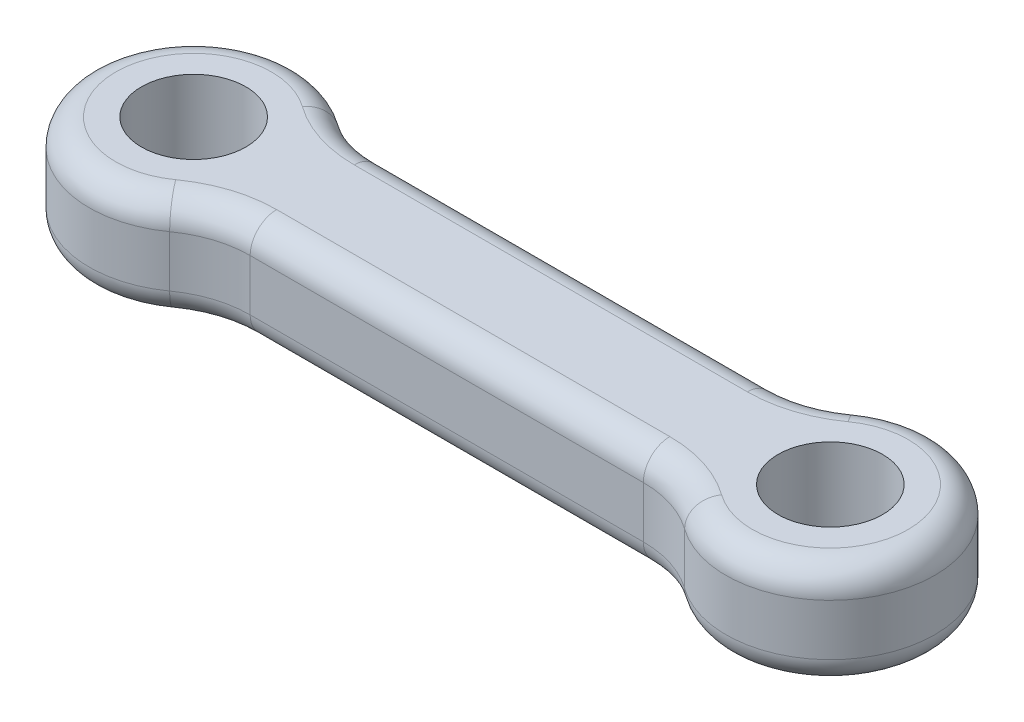
ISO-10303-21;
HEADER;
FILE_DESCRIPTION(('STEP AP214'),'2;1');
FILE_NAME('part.step','',(''),(''),'','','');
FILE_SCHEMA(('AUTOMOTIVE_DESIGN { 1 0 10303 214 1 1 1 1 }'));
ENDSEC;
DATA;
#1=APPLICATION_CONTEXT('core data for automotive mechanical design processes');
#2=APPLICATION_PROTOCOL_DEFINITION('international standard','automotive_design',2000,#1);
#3=PRODUCT_CONTEXT('',#1,'mechanical');
#4=PRODUCT('Part','Part','',(#3));
#5=PRODUCT_RELATED_PRODUCT_CATEGORY('part','',(#4));
#6=PRODUCT_DEFINITION_FORMATION('','',#4);
#7=PRODUCT_DEFINITION_CONTEXT('part definition',#1,'design');
#8=PRODUCT_DEFINITION('design','',#6,#7);
#9=PRODUCT_DEFINITION_SHAPE('','',#8);
#10=(LENGTH_UNIT() NAMED_UNIT(*) SI_UNIT(.MILLI.,.METRE.));
#11=(NAMED_UNIT(*) PLANE_ANGLE_UNIT() SI_UNIT($,.RADIAN.));
#12=(NAMED_UNIT(*) SI_UNIT($,.STERADIAN.) SOLID_ANGLE_UNIT());
#13=UNCERTAINTY_MEASURE_WITH_UNIT(LENGTH_MEASURE(1.E-05),#10,'distance_accuracy_value','');
#14=(GEOMETRIC_REPRESENTATION_CONTEXT(3) GLOBAL_UNCERTAINTY_ASSIGNED_CONTEXT((#13)) GLOBAL_UNIT_ASSIGNED_CONTEXT((#10,
#11,#12)) REPRESENTATION_CONTEXT('',''));
#15=CARTESIAN_POINT('',(0.,0.,0.));
#16=DIRECTION('',(0.,0.,1.));
#17=DIRECTION('',(1.,0.,0.));
#18=AXIS2_PLACEMENT_3D('',#15,#16,#17);
#19=CARTESIAN_POINT('',(2.81828771879828,8.3,-10.725));
#20=DIRECTION('',(0.,1.,0.));
#21=DIRECTION('',(0.,0.,1.));
#22=AXIS2_PLACEMENT_3D('',#19,#20,#21);
#23=PLANE('',#22);
#24=CARTESIAN_POINT('',(27.6617122812017,8.3,10.725));
#25=DIRECTION('',(0.,1.,0.));
#26=DIRECTION('',(0.,0.,1.));
#27=AXIS2_PLACEMENT_3D('',#24,#25,#26);
#28=CIRCLE('',#27,8.2764);
#29=CARTESIAN_POINT('',(27.6617122812017,8.3,2.4486));
#30=VERTEX_POINT('',#29);
#31=CARTESIAN_POINT('',(32.4865322808882,8.3,4.000425));
#32=VERTEX_POINT('',#31);
#33=EDGE_CURVE('E269',#30,#32,#28,.F.);
#34=ORIENTED_EDGE('',*,*,#33,.T.);
#35=CARTESIAN_POINT('',(35.3568,8.3,0.));
#36=DIRECTION('',(0.,1.,0.));
#37=DIRECTION('',(0.,0.,1.));
#38=AXIS2_PLACEMENT_3D('',#35,#36,#37);
#39=CIRCLE('',#38,4.9236);
#40=CARTESIAN_POINT('',(32.4865322808882,8.3,-4.000425));
#41=VERTEX_POINT('',#40);
#42=EDGE_CURVE('E156',#32,#41,#39,.T.);
#43=ORIENTED_EDGE('',*,*,#42,.T.);
#44=CARTESIAN_POINT('',(27.6617122812017,8.3,-10.725));
#45=DIRECTION('',(0.,1.,0.));
#46=DIRECTION('',(0.,0.,1.));
#47=AXIS2_PLACEMENT_3D('',#44,#45,#46);
#48=CIRCLE('',#47,8.2764);
#49=CARTESIAN_POINT('',(27.6617122812017,8.3,-2.4486));
#50=VERTEX_POINT('',#49);
#51=EDGE_CURVE('E150',#41,#50,#48,.F.);
#52=ORIENTED_EDGE('',*,*,#51,.T.);
#53=DIRECTION('',(-1.,0.,0.));
#54=VECTOR('',#53,1.);
#55=CARTESIAN_POINT('',(2.81828771879828,8.3,-2.4486));
#56=LINE('',#55,#54);
#57=CARTESIAN_POINT('',(2.81828771879828,8.3,-2.4486));
#58=VERTEX_POINT('',#57);
#59=EDGE_CURVE('E153',#50,#58,#56,.T.);
#60=ORIENTED_EDGE('',*,*,#59,.T.);
#61=CARTESIAN_POINT('',(2.81828771879828,8.3,-10.725));
#62=DIRECTION('',(0.,1.,0.));
#63=DIRECTION('',(0.,0.,1.));
#64=AXIS2_PLACEMENT_3D('',#61,#62,#63);
#65=CIRCLE('',#64,8.2764);
#66=CARTESIAN_POINT('',(-2.00653228088824,8.3,-4.000425));
#67=VERTEX_POINT('',#66);
#68=EDGE_CURVE('E160',#58,#67,#65,.F.);
#69=ORIENTED_EDGE('',*,*,#68,.T.);
#70=CARTESIAN_POINT('',(-4.8768,8.3,0.));
#71=DIRECTION('',(0.,1.,0.));
#72=DIRECTION('',(0.,0.,1.));
#73=AXIS2_PLACEMENT_3D('',#70,#71,#72);
#74=CIRCLE('',#73,4.9236);
#75=CARTESIAN_POINT('',(-2.00653228088825,8.3,4.000425));
#76=VERTEX_POINT('',#75);
#77=EDGE_CURVE('E275',#67,#76,#74,.T.);
#78=ORIENTED_EDGE('',*,*,#77,.T.);
#79=CARTESIAN_POINT('',(2.81828771879828,8.3,10.725));
#80=DIRECTION('',(0.,1.,0.));
#81=DIRECTION('',(0.,0.,1.));
#82=AXIS2_PLACEMENT_3D('',#79,#80,#81);
#83=CIRCLE('',#82,8.2764);
#84=CARTESIAN_POINT('',(2.81828771879828,8.3,2.4486));
#85=VERTEX_POINT('',#84);
#86=EDGE_CURVE('E273',#76,#85,#83,.F.);
#87=ORIENTED_EDGE('',*,*,#86,.T.);
#88=DIRECTION('',(1.,0.,0.));
#89=VECTOR('',#88,1.);
#90=CARTESIAN_POINT('',(27.6617122812017,8.3,2.4486));
#91=LINE('',#90,#89);
#92=EDGE_CURVE('E271',#85,#30,#91,.T.);
#93=ORIENTED_EDGE('',*,*,#92,.T.);
#94=EDGE_LOOP('',(#34,#43,#52,#60,#69,#78,#87,#93));
#95=FACE_BOUND('',#94,.T.);
#96=CARTESIAN_POINT('',(-4.8768,8.3,0.));
#97=DIRECTION('',(0.,1.,0.));
#98=DIRECTION('',(0.,0.,1.));
#99=AXIS2_PLACEMENT_3D('',#96,#97,#98);
#100=CIRCLE('',#99,3.3);
#101=CARTESIAN_POINT('',(-4.8768,8.3,3.3));
#102=VERTEX_POINT('',#101);
#103=EDGE_CURVE('E299',#102,#102,#100,.T.);
#104=ORIENTED_EDGE('',*,*,#103,.F.);
#105=EDGE_LOOP('',(#104));
#106=FACE_BOUND('',#105,.T.);
#107=CARTESIAN_POINT('',(35.3568,8.3,0.));
#108=DIRECTION('',(0.,1.,0.));
#109=DIRECTION('',(0.,0.,-1.));
#110=AXIS2_PLACEMENT_3D('',#107,#108,#109);
#111=CIRCLE('',#110,3.3);
#112=CARTESIAN_POINT('',(35.3568,8.3,-3.3));
#113=VERTEX_POINT('',#112);
#114=EDGE_CURVE('E303',#113,#113,#111,.T.);
#115=ORIENTED_EDGE('',*,*,#114,.F.);
#116=EDGE_LOOP('',(#115));
#117=FACE_BOUND('',#116,.T.);
#118=ADVANCED_FACE('F35',(#95,#106,#117),#23,.T.);
#119=CARTESIAN_POINT('',(2.81828771879828,1.7,-10.725));
#120=DIRECTION('',(0.,1.,0.));
#121=DIRECTION('',(0.,0.,1.));
#122=AXIS2_PLACEMENT_3D('',#119,#120,#121);
#123=PLANE('',#122);
#124=CARTESIAN_POINT('',(2.81828771879828,1.7,10.725));
#125=DIRECTION('',(0.,1.,0.));
#126=DIRECTION('',(0.,0.,1.));
#127=AXIS2_PLACEMENT_3D('',#124,#125,#126);
#128=CIRCLE('',#127,8.2764);
#129=CARTESIAN_POINT('',(2.81828771879828,1.7,2.4486));
#130=VERTEX_POINT('',#129);
#131=CARTESIAN_POINT('',(-2.00653228088824,1.7,4.000425));
#132=VERTEX_POINT('',#131);
#133=EDGE_CURVE('E228',#130,#132,#128,.T.);
#134=ORIENTED_EDGE('',*,*,#133,.T.);
#135=CARTESIAN_POINT('',(-4.8768,1.7,0.));
#136=DIRECTION('',(0.,1.,0.));
#137=DIRECTION('',(0.,0.,1.));
#138=AXIS2_PLACEMENT_3D('',#135,#136,#137);
#139=CIRCLE('',#138,4.9236);
#140=CARTESIAN_POINT('',(-2.00653228088824,1.7,-4.000425));
#141=VERTEX_POINT('',#140);
#142=EDGE_CURVE('E225',#132,#141,#139,.F.);
#143=ORIENTED_EDGE('',*,*,#142,.T.);
#144=CARTESIAN_POINT('',(2.81828771879828,1.7,-10.725));
#145=DIRECTION('',(0.,1.,0.));
#146=DIRECTION('',(0.,0.,1.));
#147=AXIS2_PLACEMENT_3D('',#144,#145,#146);
#148=CIRCLE('',#147,8.2764);
#149=CARTESIAN_POINT('',(2.81828771879828,1.7,-2.4486));
#150=VERTEX_POINT('',#149);
#151=EDGE_CURVE('E240',#141,#150,#148,.T.);
#152=ORIENTED_EDGE('',*,*,#151,.T.);
#153=DIRECTION('',(-1.,0.,0.));
#154=VECTOR('',#153,1.);
#155=CARTESIAN_POINT('',(2.81828771879828,1.7,-2.4486));
#156=LINE('',#155,#154);
#157=CARTESIAN_POINT('',(27.6617122812017,1.7,-2.4486));
#158=VERTEX_POINT('',#157);
#159=EDGE_CURVE('E238',#150,#158,#156,.F.);
#160=ORIENTED_EDGE('',*,*,#159,.T.);
#161=CARTESIAN_POINT('',(27.6617122812017,1.7,-10.725));
#162=DIRECTION('',(0.,1.,0.));
#163=DIRECTION('',(0.,0.,1.));
#164=AXIS2_PLACEMENT_3D('',#161,#162,#163);
#165=CIRCLE('',#164,8.2764);
#166=CARTESIAN_POINT('',(32.4865322808882,1.7,-4.000425));
#167=VERTEX_POINT('',#166);
#168=EDGE_CURVE('E236',#158,#167,#165,.T.);
#169=ORIENTED_EDGE('',*,*,#168,.T.);
#170=CARTESIAN_POINT('',(35.3568,1.7,0.));
#171=DIRECTION('',(0.,1.,0.));
#172=DIRECTION('',(0.,0.,1.));
#173=AXIS2_PLACEMENT_3D('',#170,#171,#172);
#174=CIRCLE('',#173,4.9236);
#175=CARTESIAN_POINT('',(32.4865322808882,1.7,4.000425));
#176=VERTEX_POINT('',#175);
#177=EDGE_CURVE('E234',#167,#176,#174,.F.);
#178=ORIENTED_EDGE('',*,*,#177,.T.);
#179=CARTESIAN_POINT('',(27.6617122812017,1.7,10.725));
#180=DIRECTION('',(0.,1.,0.));
#181=DIRECTION('',(0.,0.,1.));
#182=AXIS2_PLACEMENT_3D('',#179,#180,#181);
#183=CIRCLE('',#182,8.2764);
#184=CARTESIAN_POINT('',(27.6617122812017,1.7,2.4486));
#185=VERTEX_POINT('',#184);
#186=EDGE_CURVE('E232',#176,#185,#183,.T.);
#187=ORIENTED_EDGE('',*,*,#186,.T.);
#188=DIRECTION('',(1.,0.,0.));
#189=VECTOR('',#188,1.);
#190=CARTESIAN_POINT('',(2.81828771879828,1.7,2.4486));
#191=LINE('',#190,#189);
#192=EDGE_CURVE('E230',#185,#130,#191,.F.);
#193=ORIENTED_EDGE('',*,*,#192,.T.);
#194=EDGE_LOOP('',(#134,#143,#152,#160,#169,#178,#187,#193));
#195=FACE_BOUND('',#194,.T.);
#196=CARTESIAN_POINT('',(-4.8768,1.7,0.));
#197=DIRECTION('',(0.,1.,0.));
#198=DIRECTION('',(0.,0.,1.));
#199=AXIS2_PLACEMENT_3D('',#196,#197,#198);
#200=CIRCLE('',#199,3.3);
#201=CARTESIAN_POINT('',(-4.8768,1.7,3.3));
#202=VERTEX_POINT('',#201);
#203=EDGE_CURVE('E300',#202,#202,#200,.T.);
#204=ORIENTED_EDGE('',*,*,#203,.T.);
#205=EDGE_LOOP('',(#204));
#206=FACE_BOUND('',#205,.T.);
#207=CARTESIAN_POINT('',(35.3568,1.7,0.));
#208=DIRECTION('',(0.,1.,0.));
#209=DIRECTION('',(0.,0.,-1.));
#210=AXIS2_PLACEMENT_3D('',#207,#208,#209);
#211=CIRCLE('',#210,3.3);
#212=CARTESIAN_POINT('',(35.3568,1.7,-3.3));
#213=VERTEX_POINT('',#212);
#214=EDGE_CURVE('E193',#213,#213,#211,.T.);
#215=ORIENTED_EDGE('',*,*,#214,.T.);
#216=EDGE_LOOP('',(#215));
#217=FACE_BOUND('',#216,.T.);
#218=ADVANCED_FACE('F315',(#195,#206,#217),#123,.F.);
#219=CARTESIAN_POINT('',(2.81828771879828,8.3,-10.725));
#220=DIRECTION('',(0.,-1.,0.));
#221=DIRECTION('',(0.,0.,-1.));
#222=AXIS2_PLACEMENT_3D('',#219,#220,#221);
#223=CYLINDRICAL_SURFACE('',#222,6.6);
#224=DIRECTION('',(0.,-1.,0.));
#225=VECTOR('',#224,1.);
#226=CARTESIAN_POINT('',(-1.02925614060086,8.3,-5.3625));
#227=LINE('',#226,#225);
#228=CARTESIAN_POINT('',(-1.02925614060086,6.6236,-5.3625));
#229=VERTEX_POINT('',#228);
#230=CARTESIAN_POINT('',(-1.02925614060086,3.3764,-5.3625));
#231=VERTEX_POINT('',#230);
#232=EDGE_CURVE('E170',#229,#231,#227,.T.);
#233=ORIENTED_EDGE('',*,*,#232,.F.);
#234=CARTESIAN_POINT('',(2.81828771879828,6.6236,-10.725));
#235=DIRECTION('',(0.,1.,0.));
#236=DIRECTION('',(0.,0.,1.));
#237=AXIS2_PLACEMENT_3D('',#234,#235,#236);
#238=CIRCLE('',#237,6.6);
#239=CARTESIAN_POINT('',(2.81828771879828,6.6236,-4.125));
#240=VERTEX_POINT('',#239);
#241=EDGE_CURVE('E242',#229,#240,#238,.T.);
#242=ORIENTED_EDGE('',*,*,#241,.T.);
#243=DIRECTION('',(0.,-1.,0.));
#244=VECTOR('',#243,1.);
#245=CARTESIAN_POINT('',(2.81828771879828,8.3,-4.125));
#246=LINE('',#245,#244);
#247=CARTESIAN_POINT('',(2.81828771879828,3.3764,-4.125));
#248=VERTEX_POINT('',#247);
#249=EDGE_CURVE('E296',#240,#248,#246,.T.);
#250=ORIENTED_EDGE('',*,*,#249,.T.);
#251=CARTESIAN_POINT('',(2.81828771879828,3.3764,-10.725));
#252=DIRECTION('',(0.,1.,0.));
#253=DIRECTION('',(0.,0.,1.));
#254=AXIS2_PLACEMENT_3D('',#251,#252,#253);
#255=CIRCLE('',#254,6.6);
#256=EDGE_CURVE('E244',#248,#231,#255,.F.);
#257=ORIENTED_EDGE('',*,*,#256,.T.);
#258=EDGE_LOOP('',(#233,#242,#250,#257));
#259=FACE_BOUND('',#258,.T.);
#260=ADVANCED_FACE('F320',(#259),#223,.F.);
#261=CARTESIAN_POINT('',(-4.8768,8.3,0.));
#262=DIRECTION('',(0.,-1.,0.));
#263=DIRECTION('',(0.,0.,-1.));
#264=AXIS2_PLACEMENT_3D('',#261,#262,#263);
#265=CYLINDRICAL_SURFACE('',#264,6.6);
#266=DIRECTION('',(0.,-1.,0.));
#267=VECTOR('',#266,1.);
#268=CARTESIAN_POINT('',(-1.02925614060086,8.3,5.3625));
#269=LINE('',#268,#267);
#270=CARTESIAN_POINT('',(-1.02925614060086,6.6236,5.3625));
#271=VERTEX_POINT('',#270);
#272=CARTESIAN_POINT('',(-1.02925614060086,3.3764,5.3625));
#273=VERTEX_POINT('',#272);
#274=EDGE_CURVE('E280',#271,#273,#269,.T.);
#275=ORIENTED_EDGE('',*,*,#274,.F.);
#276=CARTESIAN_POINT('',(-4.8768,6.6236,0.));
#277=DIRECTION('',(0.,1.,0.));
#278=DIRECTION('',(0.,0.,1.));
#279=AXIS2_PLACEMENT_3D('',#276,#277,#278);
#280=CIRCLE('',#279,6.6);
#281=EDGE_CURVE('E246',#271,#229,#280,.F.);
#282=ORIENTED_EDGE('',*,*,#281,.T.);
#283=ORIENTED_EDGE('',*,*,#232,.T.);
#284=CARTESIAN_POINT('',(-4.8768,3.3764,0.));
#285=DIRECTION('',(0.,1.,0.));
#286=DIRECTION('',(0.,0.,1.));
#287=AXIS2_PLACEMENT_3D('',#284,#285,#286);
#288=CIRCLE('',#287,6.6);
#289=EDGE_CURVE('E248',#231,#273,#288,.T.);
#290=ORIENTED_EDGE('',*,*,#289,.T.);
#291=EDGE_LOOP('',(#275,#282,#283,#290));
#292=FACE_BOUND('',#291,.T.);
#293=ADVANCED_FACE('F348',(#292),#265,.T.);
#294=CARTESIAN_POINT('',(2.81828771879828,8.3,10.725));
#295=DIRECTION('',(0.,-1.,0.));
#296=DIRECTION('',(0.,0.,-1.));
#297=AXIS2_PLACEMENT_3D('',#294,#295,#296);
#298=CYLINDRICAL_SURFACE('',#297,6.6);
#299=DIRECTION('',(0.,-1.,0.));
#300=VECTOR('',#299,1.);
#301=CARTESIAN_POINT('',(2.81828771879828,8.3,4.125));
#302=LINE('',#301,#300);
#303=CARTESIAN_POINT('',(2.81828771879828,6.6236,4.125));
#304=VERTEX_POINT('',#303);
#305=CARTESIAN_POINT('',(2.81828771879828,3.3764,4.125));
#306=VERTEX_POINT('',#305);
#307=EDGE_CURVE('E283',#304,#306,#302,.T.);
#308=ORIENTED_EDGE('',*,*,#307,.F.);
#309=CARTESIAN_POINT('',(2.81828771879828,6.6236,10.725));
#310=DIRECTION('',(0.,1.,0.));
#311=DIRECTION('',(0.,0.,1.));
#312=AXIS2_PLACEMENT_3D('',#309,#310,#311);
#313=CIRCLE('',#312,6.6);
#314=EDGE_CURVE('E251',#304,#271,#313,.T.);
#315=ORIENTED_EDGE('',*,*,#314,.T.);
#316=ORIENTED_EDGE('',*,*,#274,.T.);
#317=CARTESIAN_POINT('',(2.81828771879828,3.3764,10.725));
#318=DIRECTION('',(0.,1.,0.));
#319=DIRECTION('',(0.,0.,1.));
#320=AXIS2_PLACEMENT_3D('',#317,#318,#319);
#321=CIRCLE('',#320,6.6);
#322=EDGE_CURVE('E253',#273,#306,#321,.F.);
#323=ORIENTED_EDGE('',*,*,#322,.T.);
#324=EDGE_LOOP('',(#308,#315,#316,#323));
#325=FACE_BOUND('',#324,.T.);
#326=ADVANCED_FACE('F344',(#325),#298,.F.);
#327=CARTESIAN_POINT('',(2.81828771879828,8.3,4.125));
#328=DIRECTION('',(0.,0.,-1.));
#329=DIRECTION('',(-1.,0.,0.));
#330=AXIS2_PLACEMENT_3D('',#327,#328,#329);
#331=PLANE('',#330);
#332=DIRECTION('',(0.,-1.,0.));
#333=VECTOR('',#332,1.);
#334=CARTESIAN_POINT('',(27.6617122812017,8.3,4.125));
#335=LINE('',#334,#333);
#336=CARTESIAN_POINT('',(27.6617122812017,6.6236,4.125));
#337=VERTEX_POINT('',#336);
#338=CARTESIAN_POINT('',(27.6617122812017,3.3764,4.125));
#339=VERTEX_POINT('',#338);
#340=EDGE_CURVE('E286',#337,#339,#335,.T.);
#341=ORIENTED_EDGE('',*,*,#340,.F.);
#342=DIRECTION('',(1.,0.,0.));
#343=VECTOR('',#342,1.);
#344=CARTESIAN_POINT('',(2.81828771879828,6.6236,4.125));
#345=LINE('',#344,#343);
#346=EDGE_CURVE('E255',#337,#304,#345,.F.);
#347=ORIENTED_EDGE('',*,*,#346,.T.);
#348=ORIENTED_EDGE('',*,*,#307,.T.);
#349=DIRECTION('',(1.,0.,0.));
#350=VECTOR('',#349,1.);
#351=CARTESIAN_POINT('',(2.81828771879828,3.3764,4.125));
#352=LINE('',#351,#350);
#353=EDGE_CURVE('E257',#306,#339,#352,.T.);
#354=ORIENTED_EDGE('',*,*,#353,.T.);
#355=EDGE_LOOP('',(#341,#347,#348,#354));
#356=FACE_BOUND('',#355,.T.);
#357=ADVANCED_FACE('F340',(#356),#331,.F.);
#358=CARTESIAN_POINT('',(27.6617122812017,8.3,10.725));
#359=DIRECTION('',(0.,-1.,0.));
#360=DIRECTION('',(0.,0.,-1.));
#361=AXIS2_PLACEMENT_3D('',#358,#359,#360);
#362=CYLINDRICAL_SURFACE('',#361,6.6);
#363=DIRECTION('',(0.,-1.,0.));
#364=VECTOR('',#363,1.);
#365=CARTESIAN_POINT('',(31.5092561406009,8.3,5.3625));
#366=LINE('',#365,#364);
#367=CARTESIAN_POINT('',(31.5092561406009,6.6236,5.3625));
#368=VERTEX_POINT('',#367);
#369=CARTESIAN_POINT('',(31.5092561406009,3.3764,5.3625));
#370=VERTEX_POINT('',#369);
#371=EDGE_CURVE('E289',#368,#370,#366,.T.);
#372=ORIENTED_EDGE('',*,*,#371,.F.);
#373=CARTESIAN_POINT('',(27.6617122812017,6.6236,10.725));
#374=DIRECTION('',(0.,1.,0.));
#375=DIRECTION('',(0.,0.,1.));
#376=AXIS2_PLACEMENT_3D('',#373,#374,#375);
#377=CIRCLE('',#376,6.6);
#378=EDGE_CURVE('E259',#368,#337,#377,.T.);
#379=ORIENTED_EDGE('',*,*,#378,.T.);
#380=ORIENTED_EDGE('',*,*,#340,.T.);
#381=CARTESIAN_POINT('',(27.6617122812017,3.3764,10.725));
#382=DIRECTION('',(0.,1.,0.));
#383=DIRECTION('',(0.,0.,1.));
#384=AXIS2_PLACEMENT_3D('',#381,#382,#383);
#385=CIRCLE('',#384,6.6);
#386=EDGE_CURVE('E261',#339,#370,#385,.F.);
#387=ORIENTED_EDGE('',*,*,#386,.T.);
#388=EDGE_LOOP('',(#372,#379,#380,#387));
#389=FACE_BOUND('',#388,.T.);
#390=ADVANCED_FACE('F336',(#389),#362,.F.);
#391=CARTESIAN_POINT('',(35.3568,8.3,0.));
#392=DIRECTION('',(0.,-1.,0.));
#393=DIRECTION('',(0.,0.,-1.));
#394=AXIS2_PLACEMENT_3D('',#391,#392,#393);
#395=CYLINDRICAL_SURFACE('',#394,6.6);
#396=DIRECTION('',(0.,-1.,0.));
#397=VECTOR('',#396,1.);
#398=CARTESIAN_POINT('',(31.5092561406009,8.3,-5.3625));
#399=LINE('',#398,#397);
#400=CARTESIAN_POINT('',(31.5092561406009,6.6236,-5.3625));
#401=VERTEX_POINT('',#400);
#402=CARTESIAN_POINT('',(31.5092561406009,3.3764,-5.3625));
#403=VERTEX_POINT('',#402);
#404=EDGE_CURVE('E292',#401,#403,#399,.T.);
#405=ORIENTED_EDGE('',*,*,#404,.F.);
#406=CARTESIAN_POINT('',(35.3568,6.6236,0.));
#407=DIRECTION('',(0.,1.,0.));
#408=DIRECTION('',(0.,0.,1.));
#409=AXIS2_PLACEMENT_3D('',#406,#407,#408);
#410=CIRCLE('',#409,6.6);
#411=EDGE_CURVE('E263',#401,#368,#410,.F.);
#412=ORIENTED_EDGE('',*,*,#411,.T.);
#413=ORIENTED_EDGE('',*,*,#371,.T.);
#414=CARTESIAN_POINT('',(35.3568,3.3764,0.));
#415=DIRECTION('',(0.,1.,0.));
#416=DIRECTION('',(0.,0.,1.));
#417=AXIS2_PLACEMENT_3D('',#414,#415,#416);
#418=CIRCLE('',#417,6.6);
#419=EDGE_CURVE('E266',#370,#403,#418,.T.);
#420=ORIENTED_EDGE('',*,*,#419,.T.);
#421=EDGE_LOOP('',(#405,#412,#413,#420));
#422=FACE_BOUND('',#421,.T.);
#423=ADVANCED_FACE('F333',(#422),#395,.T.);
#424=CARTESIAN_POINT('',(27.6617122812017,8.3,-10.725));
#425=DIRECTION('',(0.,-1.,0.));
#426=DIRECTION('',(0.,0.,-1.));
#427=AXIS2_PLACEMENT_3D('',#424,#425,#426);
#428=CYLINDRICAL_SURFACE('',#427,6.6);
#429=ORIENTED_EDGE('',*,*,#404,.T.);
#430=CARTESIAN_POINT('',(27.6617122812017,3.3764,-10.725));
#431=DIRECTION('',(0.,1.,0.));
#432=DIRECTION('',(0.,0.,1.));
#433=AXIS2_PLACEMENT_3D('',#430,#431,#432);
#434=CIRCLE('',#433,6.6);
#435=CARTESIAN_POINT('',(27.6617122812017,3.3764,-4.125));
#436=VERTEX_POINT('',#435);
#437=EDGE_CURVE('E52',#403,#436,#434,.F.);
#438=ORIENTED_EDGE('',*,*,#437,.T.);
#439=DIRECTION('',(0.,-1.,0.));
#440=VECTOR('',#439,1.);
#441=CARTESIAN_POINT('',(27.6617122812017,8.3,-4.125));
#442=LINE('',#441,#440);
#443=CARTESIAN_POINT('',(27.6617122812017,6.6236,-4.125));
#444=VERTEX_POINT('',#443);
#445=EDGE_CURVE('E294',#444,#436,#442,.T.);
#446=ORIENTED_EDGE('',*,*,#445,.F.);
#447=CARTESIAN_POINT('',(27.6617122812017,6.6236,-10.725));
#448=DIRECTION('',(0.,1.,0.));
#449=DIRECTION('',(0.,0.,1.));
#450=AXIS2_PLACEMENT_3D('',#447,#448,#449);
#451=CIRCLE('',#450,6.6);
#452=EDGE_CURVE('E173',#444,#401,#451,.T.);
#453=ORIENTED_EDGE('',*,*,#452,.T.);
#454=EDGE_LOOP('',(#429,#438,#446,#453));
#455=FACE_BOUND('',#454,.T.);
#456=ADVANCED_FACE('F330',(#455),#428,.F.);
#457=CARTESIAN_POINT('',(2.81828771879828,8.3,-4.125));
#458=DIRECTION('',(0.,0.,1.));
#459=DIRECTION('',(1.,0.,0.));
#460=AXIS2_PLACEMENT_3D('',#457,#458,#459);
#461=PLANE('',#460);
#462=ORIENTED_EDGE('',*,*,#445,.T.);
#463=DIRECTION('',(-1.,0.,0.));
#464=VECTOR('',#463,1.);
#465=CARTESIAN_POINT('',(2.81828771879828,3.3764,-4.125));
#466=LINE('',#465,#464);
#467=EDGE_CURVE('E11',#436,#248,#466,.T.);
#468=ORIENTED_EDGE('',*,*,#467,.T.);
#469=ORIENTED_EDGE('',*,*,#249,.F.);
#470=DIRECTION('',(-1.,0.,0.));
#471=VECTOR('',#470,1.);
#472=CARTESIAN_POINT('',(27.6617122812017,6.6236,-4.125));
#473=LINE('',#472,#471);
#474=EDGE_CURVE('E44',#240,#444,#473,.F.);
#475=ORIENTED_EDGE('',*,*,#474,.T.);
#476=EDGE_LOOP('',(#462,#468,#469,#475));
#477=FACE_BOUND('',#476,.T.);
#478=ADVANCED_FACE('F327',(#477),#461,.F.);
#479=CARTESIAN_POINT('',(-4.8768,8.3,0.));
#480=DIRECTION('',(0.,-1.,0.));
#481=DIRECTION('',(0.,0.,-1.));
#482=AXIS2_PLACEMENT_3D('',#479,#480,#481);
#483=CYLINDRICAL_SURFACE('',#482,3.3);
#484=ORIENTED_EDGE('',*,*,#103,.T.);
#485=EDGE_LOOP('',(#484));
#486=FACE_BOUND('',#485,.T.);
#487=ORIENTED_EDGE('',*,*,#203,.F.);
#488=EDGE_LOOP('',(#487));
#489=FACE_BOUND('',#488,.T.);
#490=ADVANCED_FACE('F324',(#486,#489),#483,.F.);
#491=CARTESIAN_POINT('',(35.3568,8.3,0.));
#492=DIRECTION('',(0.,-1.,0.));
#493=DIRECTION('',(0.,0.,-1.));
#494=AXIS2_PLACEMENT_3D('',#491,#492,#493);
#495=CYLINDRICAL_SURFACE('',#494,3.3);
#496=ORIENTED_EDGE('',*,*,#114,.T.);
#497=EDGE_LOOP('',(#496));
#498=FACE_BOUND('',#497,.T.);
#499=ORIENTED_EDGE('',*,*,#214,.F.);
#500=EDGE_LOOP('',(#499));
#501=FACE_BOUND('',#500,.T.);
#502=ADVANCED_FACE('F311',(#498,#501),#495,.F.);
#503=CARTESIAN_POINT('',(-4.8768,6.6236,0.));
#504=DIRECTION('',(0.,1.,0.));
#505=DIRECTION('',(0.,0.,1.));
#506=AXIS2_PLACEMENT_3D('',#503,#504,#505);
#507=TOROIDAL_SURFACE('',#506,4.9236,1.6764);
#508=CARTESIAN_POINT('',(-2.00653228088824,6.6236,-4.000425));
#509=DIRECTION('',(0.8125,0.,0.582961190818051));
#510=DIRECTION('',(0.582961190818051,0.,-0.8125));
#511=AXIS2_PLACEMENT_3D('',#508,#509,#510);
#512=CIRCLE('',#511,1.6764);
#513=EDGE_CURVE('E187',#229,#67,#512,.T.);
#514=ORIENTED_EDGE('',*,*,#513,.F.);
#515=ORIENTED_EDGE('',*,*,#281,.F.);
#516=CARTESIAN_POINT('',(-2.00653228088825,6.6236,4.000425));
#517=DIRECTION('',(0.8125,0.,-0.582961190818051));
#518=DIRECTION('',(-0.582961190818051,0.,-0.8125));
#519=AXIS2_PLACEMENT_3D('',#516,#517,#518);
#520=CIRCLE('',#519,1.6764);
#521=EDGE_CURVE('E190',#76,#271,#520,.T.);
#522=ORIENTED_EDGE('',*,*,#521,.F.);
#523=ORIENTED_EDGE('',*,*,#77,.F.);
#524=EDGE_LOOP('',(#514,#515,#522,#523));
#525=FACE_BOUND('',#524,.T.);
#526=ADVANCED_FACE('F378',(#525),#507,.T.);
#527=CARTESIAN_POINT('',(2.81828771879828,6.6236,10.725));
#528=DIRECTION('',(0.,1.,0.));
#529=DIRECTION('',(0.,0.,1.));
#530=AXIS2_PLACEMENT_3D('',#527,#528,#529);
#531=TOROIDAL_SURFACE('',#530,8.2764,1.6764);
#532=ORIENTED_EDGE('',*,*,#521,.T.);
#533=ORIENTED_EDGE('',*,*,#314,.F.);
#534=CARTESIAN_POINT('',(2.81828771879828,6.6236,2.4486));
#535=DIRECTION('',(1.,0.,0.));
#536=DIRECTION('',(0.,0.,-1.));
#537=AXIS2_PLACEMENT_3D('',#534,#535,#536);
#538=CIRCLE('',#537,1.6764);
#539=EDGE_CURVE('E184',#85,#304,#538,.T.);
#540=ORIENTED_EDGE('',*,*,#539,.F.);
#541=ORIENTED_EDGE('',*,*,#86,.F.);
#542=EDGE_LOOP('',(#532,#533,#540,#541));
#543=FACE_BOUND('',#542,.T.);
#544=ADVANCED_FACE('F374',(#543),#531,.T.);
#545=CARTESIAN_POINT('',(2.81828771879828,6.6236,-10.725));
#546=DIRECTION('',(0.,1.,0.));
#547=DIRECTION('',(0.,0.,1.));
#548=AXIS2_PLACEMENT_3D('',#545,#546,#547);
#549=TOROIDAL_SURFACE('',#548,8.2764,1.6764);
#550=ORIENTED_EDGE('',*,*,#513,.T.);
#551=ORIENTED_EDGE('',*,*,#68,.F.);
#552=CARTESIAN_POINT('',(2.81828771879828,6.6236,-2.4486));
#553=DIRECTION('',(1.,0.,0.));
#554=DIRECTION('',(0.,0.,-1.));
#555=AXIS2_PLACEMENT_3D('',#552,#553,#554);
#556=CIRCLE('',#555,1.6764);
#557=EDGE_CURVE('E169',#240,#58,#556,.T.);
#558=ORIENTED_EDGE('',*,*,#557,.F.);
#559=ORIENTED_EDGE('',*,*,#241,.F.);
#560=EDGE_LOOP('',(#550,#551,#558,#559));
#561=FACE_BOUND('',#560,.T.);
#562=ADVANCED_FACE('F370',(#561),#549,.T.);
#563=CARTESIAN_POINT('',(2.81828771879828,6.6236,2.4486));
#564=DIRECTION('',(-1.,0.,0.));
#565=DIRECTION('',(0.,0.,1.));
#566=AXIS2_PLACEMENT_3D('',#563,#564,#565);
#567=CYLINDRICAL_SURFACE('',#566,1.6764);
#568=ORIENTED_EDGE('',*,*,#539,.T.);
#569=ORIENTED_EDGE('',*,*,#346,.F.);
#570=CARTESIAN_POINT('',(27.6617122812017,6.6236,2.4486));
#571=DIRECTION('',(1.,0.,0.));
#572=DIRECTION('',(0.,0.,-1.));
#573=AXIS2_PLACEMENT_3D('',#570,#571,#572);
#574=CIRCLE('',#573,1.6764);
#575=EDGE_CURVE('E174',#30,#337,#574,.T.);
#576=ORIENTED_EDGE('',*,*,#575,.F.);
#577=ORIENTED_EDGE('',*,*,#92,.F.);
#578=EDGE_LOOP('',(#568,#569,#576,#577));
#579=FACE_BOUND('',#578,.T.);
#580=ADVANCED_FACE('F367',(#579),#567,.T.);
#581=CARTESIAN_POINT('',(2.81828771879828,6.6236,-2.4486));
#582=DIRECTION('',(1.,0.,0.));
#583=DIRECTION('',(0.,0.,-1.));
#584=AXIS2_PLACEMENT_3D('',#581,#582,#583);
#585=CYLINDRICAL_SURFACE('',#584,1.6764);
#586=ORIENTED_EDGE('',*,*,#557,.T.);
#587=ORIENTED_EDGE('',*,*,#59,.F.);
#588=CARTESIAN_POINT('',(27.6617122812017,6.6236,-2.4486));
#589=DIRECTION('',(1.,0.,0.));
#590=DIRECTION('',(0.,0.,-1.));
#591=AXIS2_PLACEMENT_3D('',#588,#589,#590);
#592=CIRCLE('',#591,1.6764);
#593=EDGE_CURVE('E166',#444,#50,#592,.T.);
#594=ORIENTED_EDGE('',*,*,#593,.F.);
#595=ORIENTED_EDGE('',*,*,#474,.F.);
#596=EDGE_LOOP('',(#586,#587,#594,#595));
#597=FACE_BOUND('',#596,.T.);
#598=ADVANCED_FACE('F165',(#597),#585,.T.);
#599=CARTESIAN_POINT('',(27.6617122812017,6.6236,10.725));
#600=DIRECTION('',(0.,1.,0.));
#601=DIRECTION('',(0.,0.,1.));
#602=AXIS2_PLACEMENT_3D('',#599,#600,#601);
#603=TOROIDAL_SURFACE('',#602,8.2764,1.6764);
#604=ORIENTED_EDGE('',*,*,#575,.T.);
#605=ORIENTED_EDGE('',*,*,#378,.F.);
#606=CARTESIAN_POINT('',(32.4865322808882,6.6236,4.000425));
#607=DIRECTION('',(0.812499999999999,0.,0.582961190818052));
#608=DIRECTION('',(0.582961190818052,0.,-0.812499999999999));
#609=AXIS2_PLACEMENT_3D('',#606,#607,#608);
#610=CIRCLE('',#609,1.6764);
#611=EDGE_CURVE('E175',#32,#368,#610,.T.);
#612=ORIENTED_EDGE('',*,*,#611,.F.);
#613=ORIENTED_EDGE('',*,*,#33,.F.);
#614=EDGE_LOOP('',(#604,#605,#612,#613));
#615=FACE_BOUND('',#614,.T.);
#616=ADVANCED_FACE('F361',(#615),#603,.T.);
#617=CARTESIAN_POINT('',(27.6617122812017,6.6236,-10.725));
#618=DIRECTION('',(0.,1.,0.));
#619=DIRECTION('',(0.,0.,1.));
#620=AXIS2_PLACEMENT_3D('',#617,#618,#619);
#621=TOROIDAL_SURFACE('',#620,8.2764,1.6764);
#622=ORIENTED_EDGE('',*,*,#593,.T.);
#623=ORIENTED_EDGE('',*,*,#51,.F.);
#624=CARTESIAN_POINT('',(32.4865322808882,6.6236,-4.000425));
#625=DIRECTION('',(0.812499999999999,0.,-0.582961190818052));
#626=DIRECTION('',(-0.582961190818052,0.,-0.812499999999999));
#627=AXIS2_PLACEMENT_3D('',#624,#625,#626);
#628=CIRCLE('',#627,1.6764);
#629=EDGE_CURVE('E179',#401,#41,#628,.T.);
#630=ORIENTED_EDGE('',*,*,#629,.F.);
#631=ORIENTED_EDGE('',*,*,#452,.F.);
#632=EDGE_LOOP('',(#622,#623,#630,#631));
#633=FACE_BOUND('',#632,.T.);
#634=ADVANCED_FACE('F172',(#633),#621,.T.);
#635=CARTESIAN_POINT('',(35.3568,6.6236,0.));
#636=DIRECTION('',(0.,1.,0.));
#637=DIRECTION('',(0.,0.,1.));
#638=AXIS2_PLACEMENT_3D('',#635,#636,#637);
#639=TOROIDAL_SURFACE('',#638,4.9236,1.6764);
#640=ORIENTED_EDGE('',*,*,#611,.T.);
#641=ORIENTED_EDGE('',*,*,#411,.F.);
#642=ORIENTED_EDGE('',*,*,#629,.T.);
#643=ORIENTED_EDGE('',*,*,#42,.F.);
#644=EDGE_LOOP('',(#640,#641,#642,#643));
#645=FACE_BOUND('',#644,.T.);
#646=ADVANCED_FACE('F356',(#645),#639,.T.);
#647=CARTESIAN_POINT('',(35.3568,3.3764,0.));
#648=DIRECTION('',(0.,1.,0.));
#649=DIRECTION('',(0.,0.,1.));
#650=AXIS2_PLACEMENT_3D('',#647,#648,#649);
#651=TOROIDAL_SURFACE('',#650,4.9236,1.6764);
#652=CARTESIAN_POINT('',(32.4865322808882,3.3764,4.000425));
#653=DIRECTION('',(-0.812499999999999,0.,-0.582961190818052));
#654=DIRECTION('',(-0.582961190818052,0.,0.812499999999999));
#655=AXIS2_PLACEMENT_3D('',#652,#653,#654);
#656=CIRCLE('',#655,1.6764);
#657=EDGE_CURVE('E209',#176,#370,#656,.T.);
#658=ORIENTED_EDGE('',*,*,#657,.F.);
#659=ORIENTED_EDGE('',*,*,#177,.F.);
#660=CARTESIAN_POINT('',(32.4865322808882,3.3764,-4.000425));
#661=DIRECTION('',(-0.812499999999999,0.,0.582961190818052));
#662=DIRECTION('',(0.582961190818052,0.,0.812499999999999));
#663=AXIS2_PLACEMENT_3D('',#660,#661,#662);
#664=CIRCLE('',#663,1.6764);
#665=EDGE_CURVE('E39',#403,#167,#664,.T.);
#666=ORIENTED_EDGE('',*,*,#665,.F.);
#667=ORIENTED_EDGE('',*,*,#419,.F.);
#668=EDGE_LOOP('',(#658,#659,#666,#667));
#669=FACE_BOUND('',#668,.T.);
#670=ADVANCED_FACE('F37',(#669),#651,.T.);
#671=CARTESIAN_POINT('',(27.6617122812017,3.3764,-10.725));
#672=DIRECTION('',(0.,1.,0.));
#673=DIRECTION('',(0.,0.,1.));
#674=AXIS2_PLACEMENT_3D('',#671,#672,#673);
#675=TOROIDAL_SURFACE('',#674,8.2764,1.6764);
#676=ORIENTED_EDGE('',*,*,#665,.T.);
#677=ORIENTED_EDGE('',*,*,#168,.F.);
#678=CARTESIAN_POINT('',(27.6617122812017,3.3764,-2.4486));
#679=DIRECTION('',(-1.,0.,0.));
#680=DIRECTION('',(0.,0.,1.));
#681=AXIS2_PLACEMENT_3D('',#678,#679,#680);
#682=CIRCLE('',#681,1.6764);
#683=EDGE_CURVE('E207',#436,#158,#682,.T.);
#684=ORIENTED_EDGE('',*,*,#683,.F.);
#685=ORIENTED_EDGE('',*,*,#437,.F.);
#686=EDGE_LOOP('',(#676,#677,#684,#685));
#687=FACE_BOUND('',#686,.T.);
#688=ADVANCED_FACE('F405',(#687),#675,.T.);
#689=CARTESIAN_POINT('',(27.6617122812017,3.3764,10.725));
#690=DIRECTION('',(0.,1.,0.));
#691=DIRECTION('',(0.,0.,1.));
#692=AXIS2_PLACEMENT_3D('',#689,#690,#691);
#693=TOROIDAL_SURFACE('',#692,8.2764,1.6764);
#694=ORIENTED_EDGE('',*,*,#657,.T.);
#695=ORIENTED_EDGE('',*,*,#386,.F.);
#696=CARTESIAN_POINT('',(27.6617122812017,3.3764,2.4486));
#697=DIRECTION('',(-1.,0.,0.));
#698=DIRECTION('',(0.,0.,1.));
#699=AXIS2_PLACEMENT_3D('',#696,#697,#698);
#700=CIRCLE('',#699,1.6764);
#701=EDGE_CURVE('E204',#185,#339,#700,.T.);
#702=ORIENTED_EDGE('',*,*,#701,.F.);
#703=ORIENTED_EDGE('',*,*,#186,.F.);
#704=EDGE_LOOP('',(#694,#695,#702,#703));
#705=FACE_BOUND('',#704,.T.);
#706=ADVANCED_FACE('F402',(#705),#693,.T.);
#707=CARTESIAN_POINT('',(2.81828771879828,3.3764,-2.4486));
#708=DIRECTION('',(-1.,0.,0.));
#709=DIRECTION('',(0.,0.,1.));
#710=AXIS2_PLACEMENT_3D('',#707,#708,#709);
#711=CYLINDRICAL_SURFACE('',#710,1.6764);
#712=ORIENTED_EDGE('',*,*,#683,.T.);
#713=ORIENTED_EDGE('',*,*,#159,.F.);
#714=CARTESIAN_POINT('',(2.81828771879828,3.3764,-2.4486));
#715=DIRECTION('',(-1.,0.,0.));
#716=DIRECTION('',(0.,0.,1.));
#717=AXIS2_PLACEMENT_3D('',#714,#715,#716);
#718=CIRCLE('',#717,1.6764);
#719=EDGE_CURVE('E201',#248,#150,#718,.T.);
#720=ORIENTED_EDGE('',*,*,#719,.F.);
#721=ORIENTED_EDGE('',*,*,#467,.F.);
#722=EDGE_LOOP('',(#712,#713,#720,#721));
#723=FACE_BOUND('',#722,.T.);
#724=ADVANCED_FACE('F398',(#723),#711,.T.);
#725=CARTESIAN_POINT('',(2.81828771879828,3.3764,2.4486));
#726=DIRECTION('',(1.,0.,0.));
#727=DIRECTION('',(0.,0.,-1.));
#728=AXIS2_PLACEMENT_3D('',#725,#726,#727);
#729=CYLINDRICAL_SURFACE('',#728,1.6764);
#730=ORIENTED_EDGE('',*,*,#701,.T.);
#731=ORIENTED_EDGE('',*,*,#353,.F.);
#732=CARTESIAN_POINT('',(2.81828771879828,3.3764,2.4486));
#733=DIRECTION('',(-1.,0.,0.));
#734=DIRECTION('',(0.,0.,1.));
#735=AXIS2_PLACEMENT_3D('',#732,#733,#734);
#736=CIRCLE('',#735,1.6764);
#737=EDGE_CURVE('E198',#130,#306,#736,.T.);
#738=ORIENTED_EDGE('',*,*,#737,.F.);
#739=ORIENTED_EDGE('',*,*,#192,.F.);
#740=EDGE_LOOP('',(#730,#731,#738,#739));
#741=FACE_BOUND('',#740,.T.);
#742=ADVANCED_FACE('F394',(#741),#729,.T.);
#743=CARTESIAN_POINT('',(2.81828771879828,3.3764,-10.725));
#744=DIRECTION('',(0.,1.,0.));
#745=DIRECTION('',(0.,0.,1.));
#746=AXIS2_PLACEMENT_3D('',#743,#744,#745);
#747=TOROIDAL_SURFACE('',#746,8.2764,1.6764);
#748=ORIENTED_EDGE('',*,*,#719,.T.);
#749=ORIENTED_EDGE('',*,*,#151,.F.);
#750=CARTESIAN_POINT('',(-2.00653228088824,3.3764,-4.000425));
#751=DIRECTION('',(-0.8125,0.,-0.582961190818051));
#752=DIRECTION('',(-0.582961190818051,0.,0.8125));
#753=AXIS2_PLACEMENT_3D('',#750,#751,#752);
#754=CIRCLE('',#753,1.6764);
#755=EDGE_CURVE('E196',#231,#141,#754,.T.);
#756=ORIENTED_EDGE('',*,*,#755,.F.);
#757=ORIENTED_EDGE('',*,*,#256,.F.);
#758=EDGE_LOOP('',(#748,#749,#756,#757));
#759=FACE_BOUND('',#758,.T.);
#760=ADVANCED_FACE('F390',(#759),#747,.T.);
#761=CARTESIAN_POINT('',(2.81828771879828,3.3764,10.725));
#762=DIRECTION('',(0.,1.,0.));
#763=DIRECTION('',(0.,0.,1.));
#764=AXIS2_PLACEMENT_3D('',#761,#762,#763);
#765=TOROIDAL_SURFACE('',#764,8.2764,1.6764);
#766=ORIENTED_EDGE('',*,*,#737,.T.);
#767=ORIENTED_EDGE('',*,*,#322,.F.);
#768=CARTESIAN_POINT('',(-2.00653228088824,3.3764,4.000425));
#769=DIRECTION('',(-0.8125,0.,0.582961190818051));
#770=DIRECTION('',(0.582961190818051,0.,0.8125));
#771=AXIS2_PLACEMENT_3D('',#768,#769,#770);
#772=CIRCLE('',#771,1.6764);
#773=EDGE_CURVE('E194',#132,#273,#772,.T.);
#774=ORIENTED_EDGE('',*,*,#773,.F.);
#775=ORIENTED_EDGE('',*,*,#133,.F.);
#776=EDGE_LOOP('',(#766,#767,#774,#775));
#777=FACE_BOUND('',#776,.T.);
#778=ADVANCED_FACE('F386',(#777),#765,.T.);
#779=CARTESIAN_POINT('',(-4.8768,3.3764,0.));
#780=DIRECTION('',(0.,1.,0.));
#781=DIRECTION('',(0.,0.,1.));
#782=AXIS2_PLACEMENT_3D('',#779,#780,#781);
#783=TOROIDAL_SURFACE('',#782,4.9236,1.6764);
#784=ORIENTED_EDGE('',*,*,#755,.T.);
#785=ORIENTED_EDGE('',*,*,#142,.F.);
#786=ORIENTED_EDGE('',*,*,#773,.T.);
#787=ORIENTED_EDGE('',*,*,#289,.F.);
#788=EDGE_LOOP('',(#784,#785,#786,#787));
#789=FACE_BOUND('',#788,.T.);
#790=ADVANCED_FACE('F383',(#789),#783,.T.);
#791=CLOSED_SHELL('',(#118,#218,#260,#293,#326,#357,#390,#423,#456,#478,#490,#502,#526,#544,
#562,#580,#598,#616,#634,#646,#670,#688,#706,#724,#742,#760,#778,#790));
#792=MANIFOLD_SOLID_BREP('B2',#791);
#793=ADVANCED_BREP_SHAPE_REPRESENTATION('',(#18,#792),#14);
#794=SHAPE_DEFINITION_REPRESENTATION(#9,#793);
ENDSEC;
END-ISO-10303-21;
